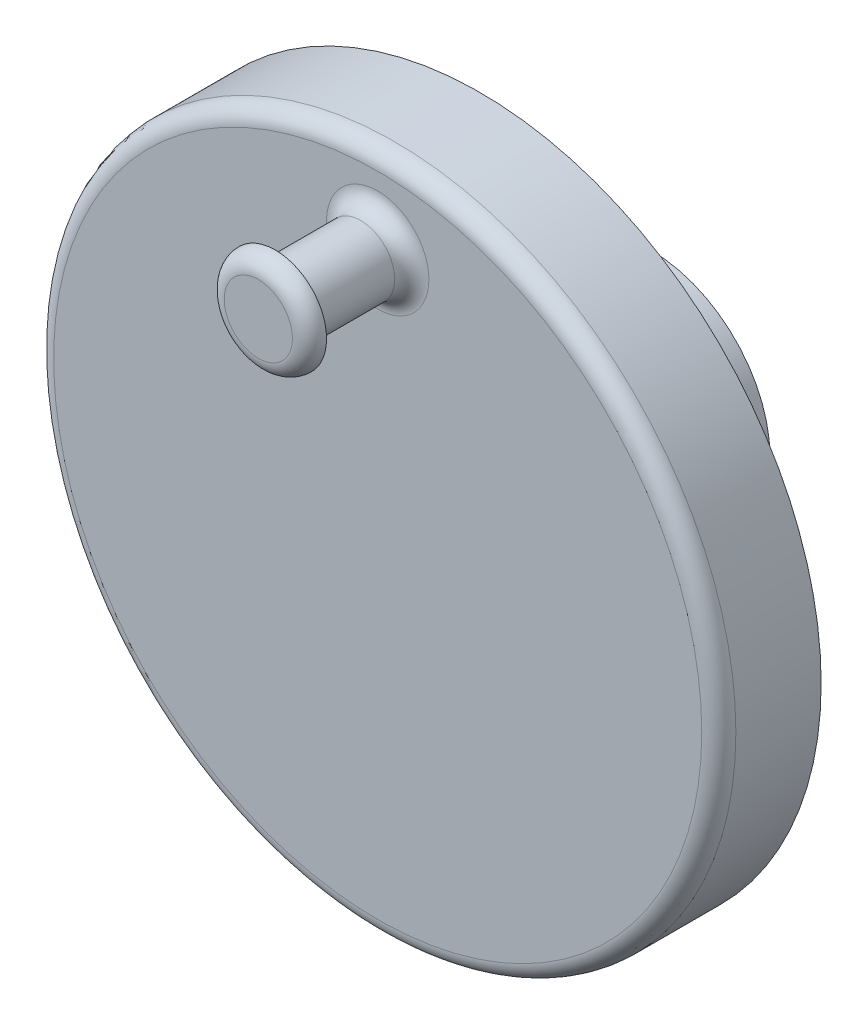
ISO-10303-21;
HEADER;
FILE_DESCRIPTION(('STEP AP214'),'2;1');
FILE_NAME('part.step','',(''),(''),'','','');
FILE_SCHEMA(('AUTOMOTIVE_DESIGN { 1 0 10303 214 1 1 1 1 }'));
ENDSEC;
DATA;
#1=APPLICATION_CONTEXT('core data for automotive mechanical design processes');
#2=APPLICATION_PROTOCOL_DEFINITION('international standard','automotive_design',2000,#1);
#3=PRODUCT_CONTEXT('',#1,'mechanical');
#4=PRODUCT('Part','Part','',(#3));
#5=PRODUCT_RELATED_PRODUCT_CATEGORY('part','',(#4));
#6=PRODUCT_DEFINITION_FORMATION('','',#4);
#7=PRODUCT_DEFINITION_CONTEXT('part definition',#1,'design');
#8=PRODUCT_DEFINITION('design','',#6,#7);
#9=PRODUCT_DEFINITION_SHAPE('','',#8);
#10=(LENGTH_UNIT() NAMED_UNIT(*) SI_UNIT(.MILLI.,.METRE.));
#11=(NAMED_UNIT(*) PLANE_ANGLE_UNIT() SI_UNIT($,.RADIAN.));
#12=(NAMED_UNIT(*) SI_UNIT($,.STERADIAN.) SOLID_ANGLE_UNIT());
#13=UNCERTAINTY_MEASURE_WITH_UNIT(LENGTH_MEASURE(1.E-05),#10,'distance_accuracy_value','');
#14=(GEOMETRIC_REPRESENTATION_CONTEXT(3) GLOBAL_UNCERTAINTY_ASSIGNED_CONTEXT((#13)) GLOBAL_UNIT_ASSIGNED_CONTEXT((#10,
#11,#12)) REPRESENTATION_CONTEXT('',''));
#15=CARTESIAN_POINT('',(0.,0.,0.));
#16=DIRECTION('',(0.,0.,1.));
#17=DIRECTION('',(1.,0.,0.));
#18=AXIS2_PLACEMENT_3D('',#15,#16,#17);
#19=CARTESIAN_POINT('',(0.,15.,13.));
#20=DIRECTION('',(0.,0.,-1.));
#21=DIRECTION('',(-1.,0.,0.));
#22=AXIS2_PLACEMENT_3D('',#19,#20,#21);
#23=CYLINDRICAL_SURFACE('',#22,2.);
#24=CARTESIAN_POINT('',(0.,15.,7.));
#25=DIRECTION('',(0.,0.,1.));
#26=DIRECTION('',(1.,0.,0.));
#27=AXIS2_PLACEMENT_3D('',#24,#25,#26);
#28=CIRCLE('',#27,2.);
#29=CARTESIAN_POINT('',(2.,15.,7.));
#30=VERTEX_POINT('',#29);
#31=EDGE_CURVE('E55',#30,#30,#28,.T.);
#32=ORIENTED_EDGE('',*,*,#31,.T.);
#33=EDGE_LOOP('',(#32));
#34=FACE_BOUND('',#33,.T.);
#35=CARTESIAN_POINT('',(0.,15.,12.));
#36=DIRECTION('',(0.,0.,1.));
#37=DIRECTION('',(1.,0.,0.));
#38=AXIS2_PLACEMENT_3D('',#35,#36,#37);
#39=CIRCLE('',#38,2.);
#40=CARTESIAN_POINT('',(2.,15.,12.));
#41=VERTEX_POINT('',#40);
#42=EDGE_CURVE('E73',#41,#41,#39,.T.);
#43=ORIENTED_EDGE('',*,*,#42,.F.);
#44=EDGE_LOOP('',(#43));
#45=FACE_BOUND('',#44,.T.);
#46=ADVANCED_FACE('F37',(#34,#45),#23,.T.);
#47=CARTESIAN_POINT('',(0.,0.,6.));
#48=DIRECTION('',(0.,0.,-1.));
#49=DIRECTION('',(-1.,0.,0.));
#50=AXIS2_PLACEMENT_3D('',#47,#48,#49);
#51=CYLINDRICAL_SURFACE('',#50,20.);
#52=CARTESIAN_POINT('',(0.,0.,5.));
#53=DIRECTION('',(0.,0.,1.));
#54=DIRECTION('',(1.,0.,0.));
#55=AXIS2_PLACEMENT_3D('',#52,#53,#54);
#56=CIRCLE('',#55,20.);
#57=CARTESIAN_POINT('',(20.,0.,5.));
#58=VERTEX_POINT('',#57);
#59=EDGE_CURVE('E61',#58,#58,#56,.F.);
#60=ORIENTED_EDGE('',*,*,#59,.T.);
#61=EDGE_LOOP('',(#60));
#62=FACE_BOUND('',#61,.T.);
#63=CARTESIAN_POINT('',(0.,0.,0.));
#64=DIRECTION('',(0.,0.,1.));
#65=DIRECTION('',(1.,0.,0.));
#66=AXIS2_PLACEMENT_3D('',#63,#64,#65);
#67=CIRCLE('',#66,20.);
#68=CARTESIAN_POINT('',(20.,0.,0.));
#69=VERTEX_POINT('',#68);
#70=EDGE_CURVE('E77',#69,#69,#67,.T.);
#71=ORIENTED_EDGE('',*,*,#70,.T.);
#72=EDGE_LOOP('',(#71));
#73=FACE_BOUND('',#72,.T.);
#74=ADVANCED_FACE('F119',(#62,#73),#51,.T.);
#75=CARTESIAN_POINT('',(0.,0.,6.));
#76=DIRECTION('',(0.,0.,1.));
#77=DIRECTION('',(1.,0.,0.));
#78=AXIS2_PLACEMENT_3D('',#75,#76,#77);
#79=PLANE('',#78);
#80=CARTESIAN_POINT('',(0.,0.,6.));
#81=DIRECTION('',(0.,0.,1.));
#82=DIRECTION('',(1.,0.,0.));
#83=AXIS2_PLACEMENT_3D('',#80,#81,#82);
#84=CIRCLE('',#83,19.);
#85=CARTESIAN_POINT('',(19.,0.,6.));
#86=VERTEX_POINT('',#85);
#87=EDGE_CURVE('E65',#86,#86,#84,.T.);
#88=ORIENTED_EDGE('',*,*,#87,.T.);
#89=EDGE_LOOP('',(#88));
#90=FACE_BOUND('',#89,.T.);
#91=CARTESIAN_POINT('',(0.,15.,6.));
#92=DIRECTION('',(0.,0.,1.));
#93=DIRECTION('',(1.,0.,0.));
#94=AXIS2_PLACEMENT_3D('',#91,#92,#93);
#95=CIRCLE('',#94,3.);
#96=CARTESIAN_POINT('',(3.,15.,6.));
#97=VERTEX_POINT('',#96);
#98=EDGE_CURVE('E69',#97,#97,#95,.F.);
#99=ORIENTED_EDGE('',*,*,#98,.T.);
#100=EDGE_LOOP('',(#99));
#101=FACE_BOUND('',#100,.T.);
#102=ADVANCED_FACE('F125',(#90,#101),#79,.T.);
#103=CARTESIAN_POINT('',(0.,0.,0.));
#104=DIRECTION('',(0.,0.,1.));
#105=DIRECTION('',(1.,0.,0.));
#106=AXIS2_PLACEMENT_3D('',#103,#104,#105);
#107=PLANE('',#106);
#108=CARTESIAN_POINT('',(0.,0.,0.));
#109=DIRECTION('',(0.,0.,1.));
#110=DIRECTION('',(1.,0.,0.));
#111=AXIS2_PLACEMENT_3D('',#108,#109,#110);
#112=CIRCLE('',#111,8.);
#113=CARTESIAN_POINT('',(8.,0.,0.));
#114=VERTEX_POINT('',#113);
#115=EDGE_CURVE('E10',#114,#114,#112,.T.);
#116=ORIENTED_EDGE('',*,*,#115,.T.);
#117=EDGE_LOOP('',(#116));
#118=FACE_BOUND('',#117,.T.);
#119=ORIENTED_EDGE('',*,*,#70,.F.);
#120=EDGE_LOOP('',(#119));
#121=FACE_BOUND('',#120,.T.);
#122=ADVANCED_FACE('F117',(#118,#121),#107,.F.);
#123=CARTESIAN_POINT('',(0.,0.,-10.));
#124=DIRECTION('',(0.,0.,-1.));
#125=DIRECTION('',(-1.,0.,0.));
#126=AXIS2_PLACEMENT_3D('',#123,#124,#125);
#127=PLANE('',#126);
#128=CARTESIAN_POINT('',(0.,0.,-10.));
#129=DIRECTION('',(0.,0.,-1.));
#130=DIRECTION('',(-1.,0.,0.));
#131=AXIS2_PLACEMENT_3D('',#128,#129,#130);
#132=CIRCLE('',#131,7.);
#133=CARTESIAN_POINT('',(-7.,0.,-10.));
#134=VERTEX_POINT('',#133);
#135=EDGE_CURVE('E81',#134,#134,#132,.T.);
#136=ORIENTED_EDGE('',*,*,#135,.T.);
#137=EDGE_LOOP('',(#136));
#138=FACE_BOUND('',#137,.T.);
#139=CARTESIAN_POINT('',(0.,0.,-10.));
#140=DIRECTION('',(0.,0.,-1.));
#141=DIRECTION('',(-1.,0.,0.));
#142=AXIS2_PLACEMENT_3D('',#139,#140,#141);
#143=CIRCLE('',#142,3.);
#144=CARTESIAN_POINT('',(-3.,0.,-10.));
#145=VERTEX_POINT('',#144);
#146=EDGE_CURVE('E85',#145,#145,#143,.T.);
#147=ORIENTED_EDGE('',*,*,#146,.F.);
#148=EDGE_LOOP('',(#147));
#149=FACE_BOUND('',#148,.T.);
#150=ADVANCED_FACE('F134',(#138,#149),#127,.T.);
#151=CARTESIAN_POINT('',(0.,0.,-10.));
#152=DIRECTION('',(0.,0.,1.));
#153=DIRECTION('',(1.,0.,0.));
#154=AXIS2_PLACEMENT_3D('',#151,#152,#153);
#155=CYLINDRICAL_SURFACE('',#154,7.);
#156=CARTESIAN_POINT('',(0.,0.,-0.999999999999999));
#157=DIRECTION('',(0.,0.,1.));
#158=DIRECTION('',(1.,0.,0.));
#159=AXIS2_PLACEMENT_3D('',#156,#157,#158);
#160=CIRCLE('',#159,7.);
#161=CARTESIAN_POINT('',(7.,0.,-0.999999999999999));
#162=VERTEX_POINT('',#161);
#163=EDGE_CURVE('E45',#162,#162,#160,.F.);
#164=ORIENTED_EDGE('',*,*,#163,.T.);
#165=EDGE_LOOP('',(#164));
#166=FACE_BOUND('',#165,.T.);
#167=ORIENTED_EDGE('',*,*,#135,.F.);
#168=EDGE_LOOP('',(#167));
#169=FACE_BOUND('',#168,.T.);
#170=ADVANCED_FACE('F132',(#166,#169),#155,.T.);
#171=CARTESIAN_POINT('',(0.,0.,-10.));
#172=DIRECTION('',(0.,0.,1.));
#173=DIRECTION('',(1.,0.,0.));
#174=AXIS2_PLACEMENT_3D('',#171,#172,#173);
#175=CYLINDRICAL_SURFACE('',#174,3.);
#176=ORIENTED_EDGE('',*,*,#146,.T.);
#177=EDGE_LOOP('',(#176));
#178=FACE_BOUND('',#177,.T.);
#179=CARTESIAN_POINT('',(0.,0.,0.));
#180=DIRECTION('',(0.,0.,-1.));
#181=DIRECTION('',(-1.,0.,0.));
#182=AXIS2_PLACEMENT_3D('',#179,#180,#181);
#183=CIRCLE('',#182,3.);
#184=CARTESIAN_POINT('',(-3.,0.,0.));
#185=VERTEX_POINT('',#184);
#186=EDGE_CURVE('E86',#185,#185,#183,.T.);
#187=ORIENTED_EDGE('',*,*,#186,.F.);
#188=EDGE_LOOP('',(#187));
#189=FACE_BOUND('',#188,.T.);
#190=ADVANCED_FACE('F114',(#178,#189),#175,.F.);
#191=ORIENTED_EDGE('',*,*,#186,.T.);
#192=EDGE_LOOP('',(#191));
#193=FACE_BOUND('',#192,.T.);
#194=ADVANCED_FACE('F104',(#193),#107,.F.);
#195=CARTESIAN_POINT('',(0.,15.,12.));
#196=DIRECTION('',(0.,0.,1.));
#197=DIRECTION('',(1.,0.,0.));
#198=AXIS2_PLACEMENT_3D('',#195,#196,#197);
#199=PLANE('',#198);
#200=ORIENTED_EDGE('',*,*,#42,.T.);
#201=EDGE_LOOP('',(#200));
#202=FACE_BOUND('',#201,.T.);
#203=CARTESIAN_POINT('',(0.,15.,12.));
#204=DIRECTION('',(0.,0.,1.));
#205=DIRECTION('',(1.,0.,0.));
#206=AXIS2_PLACEMENT_3D('',#203,#204,#205);
#207=CIRCLE('',#206,3.);
#208=CARTESIAN_POINT('',(3.,15.,12.));
#209=VERTEX_POINT('',#208);
#210=EDGE_CURVE('E90',#209,#209,#207,.T.);
#211=ORIENTED_EDGE('',*,*,#210,.F.);
#212=EDGE_LOOP('',(#211));
#213=FACE_BOUND('',#212,.T.);
#214=ADVANCED_FACE('F101',(#202,#213),#199,.F.);
#215=CARTESIAN_POINT('',(0.,15.,13.));
#216=DIRECTION('',(0.,0.,1.));
#217=DIRECTION('',(1.,0.,0.));
#218=AXIS2_PLACEMENT_3D('',#215,#216,#217);
#219=PLANE('',#218);
#220=CARTESIAN_POINT('',(0.,15.,13.));
#221=DIRECTION('',(0.,0.,1.));
#222=DIRECTION('',(1.,0.,0.));
#223=AXIS2_PLACEMENT_3D('',#220,#221,#222);
#224=CIRCLE('',#223,2.);
#225=CARTESIAN_POINT('',(2.,15.,13.));
#226=VERTEX_POINT('',#225);
#227=EDGE_CURVE('E50',#226,#226,#224,.T.);
#228=ORIENTED_EDGE('',*,*,#227,.T.);
#229=EDGE_LOOP('',(#228));
#230=FACE_BOUND('',#229,.T.);
#231=ADVANCED_FACE('F103',(#230),#219,.T.);
#232=CARTESIAN_POINT('',(0.,0.,5.));
#233=DIRECTION('',(0.,0.,1.));
#234=DIRECTION('',(1.,0.,0.));
#235=AXIS2_PLACEMENT_3D('',#232,#233,#234);
#236=TOROIDAL_SURFACE('',#235,19.,1.);
#237=ORIENTED_EDGE('',*,*,#59,.F.);
#238=EDGE_LOOP('',(#237));
#239=FACE_BOUND('',#238,.T.);
#240=ORIENTED_EDGE('',*,*,#87,.F.);
#241=EDGE_LOOP('',(#240));
#242=FACE_BOUND('',#241,.T.);
#243=ADVANCED_FACE('F111',(#239,#242),#236,.T.);
#244=CARTESIAN_POINT('',(0.,15.,7.));
#245=DIRECTION('',(0.,0.,1.));
#246=DIRECTION('',(1.,0.,0.));
#247=AXIS2_PLACEMENT_3D('',#244,#245,#246);
#248=TOROIDAL_SURFACE('',#247,3.,1.);
#249=ORIENTED_EDGE('',*,*,#98,.F.);
#250=EDGE_LOOP('',(#249));
#251=FACE_BOUND('',#250,.T.);
#252=ORIENTED_EDGE('',*,*,#31,.F.);
#253=EDGE_LOOP('',(#252));
#254=FACE_BOUND('',#253,.T.);
#255=ADVANCED_FACE('F146',(#251,#254),#248,.F.);
#256=CARTESIAN_POINT('',(0.,15.,12.));
#257=DIRECTION('',(0.,0.,1.));
#258=DIRECTION('',(1.,0.,0.));
#259=AXIS2_PLACEMENT_3D('',#256,#257,#258);
#260=TOROIDAL_SURFACE('',#259,2.,1.);
#261=ORIENTED_EDGE('',*,*,#210,.T.);
#262=EDGE_LOOP('',(#261));
#263=FACE_BOUND('',#262,.T.);
#264=ORIENTED_EDGE('',*,*,#227,.F.);
#265=EDGE_LOOP('',(#264));
#266=FACE_BOUND('',#265,.T.);
#267=ADVANCED_FACE('F98',(#263,#266),#260,.T.);
#268=CARTESIAN_POINT('',(0.,0.,-0.999999999999999));
#269=DIRECTION('',(0.,0.,1.));
#270=DIRECTION('',(1.,0.,0.));
#271=AXIS2_PLACEMENT_3D('',#268,#269,#270);
#272=TOROIDAL_SURFACE('',#271,8.,1.);
#273=ORIENTED_EDGE('',*,*,#115,.F.);
#274=EDGE_LOOP('',(#273));
#275=FACE_BOUND('',#274,.T.);
#276=ORIENTED_EDGE('',*,*,#163,.F.);
#277=EDGE_LOOP('',(#276));
#278=FACE_BOUND('',#277,.T.);
#279=ADVANCED_FACE('F39',(#275,#278),#272,.F.);
#280=CLOSED_SHELL('',(#46,#74,#102,#122,#150,#170,#190,#194,#214,#231,#243,#255,#267,#279));
#281=MANIFOLD_SOLID_BREP('B2',#280);
#282=ADVANCED_BREP_SHAPE_REPRESENTATION('',(#18,#281),#14);
#283=SHAPE_DEFINITION_REPRESENTATION(#9,#282);
ENDSEC;
END-ISO-10303-21;
